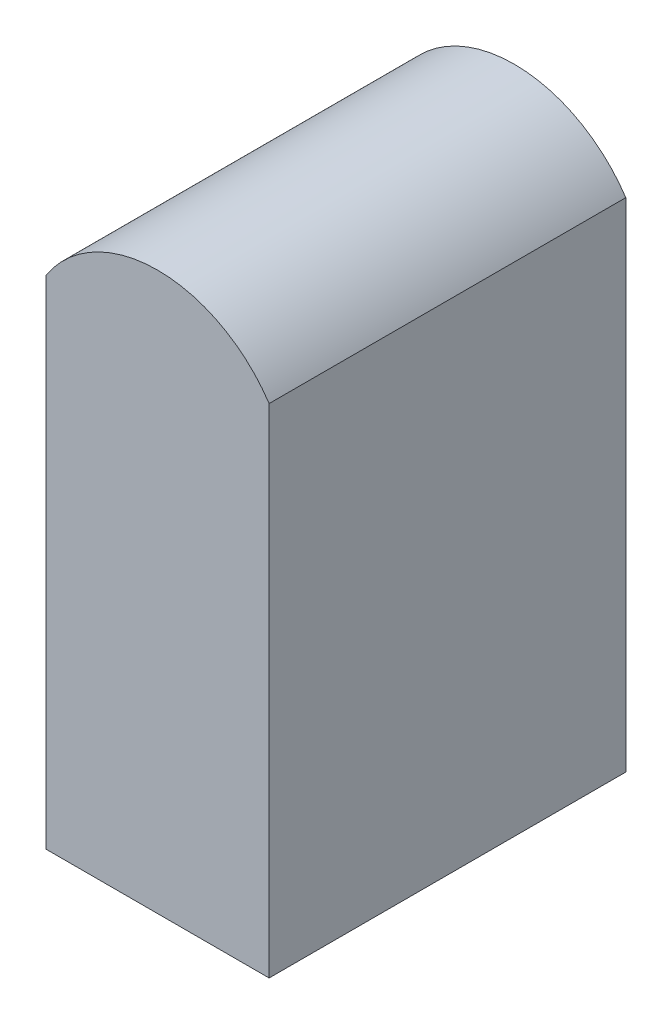
ISO-10303-21;
HEADER;
FILE_DESCRIPTION(('STEP AP214'),'2;1');
FILE_NAME('part.step','',(''),(''),'','','');
FILE_SCHEMA(('AUTOMOTIVE_DESIGN { 1 0 10303 214 1 1 1 1 }'));
ENDSEC;
DATA;
#1=APPLICATION_CONTEXT('core data for automotive mechanical design processes');
#2=APPLICATION_PROTOCOL_DEFINITION('international standard','automotive_design',2000,#1);
#3=PRODUCT_CONTEXT('',#1,'mechanical');
#4=PRODUCT('Part','Part','',(#3));
#5=PRODUCT_RELATED_PRODUCT_CATEGORY('part','',(#4));
#6=PRODUCT_DEFINITION_FORMATION('','',#4);
#7=PRODUCT_DEFINITION_CONTEXT('part definition',#1,'design');
#8=PRODUCT_DEFINITION('design','',#6,#7);
#9=PRODUCT_DEFINITION_SHAPE('','',#8);
#10=(LENGTH_UNIT() NAMED_UNIT(*) SI_UNIT(.MILLI.,.METRE.));
#11=(NAMED_UNIT(*) PLANE_ANGLE_UNIT() SI_UNIT($,.RADIAN.));
#12=(NAMED_UNIT(*) SI_UNIT($,.STERADIAN.) SOLID_ANGLE_UNIT());
#13=UNCERTAINTY_MEASURE_WITH_UNIT(LENGTH_MEASURE(1.E-05),#10,'distance_accuracy_value','');
#14=(GEOMETRIC_REPRESENTATION_CONTEXT(3) GLOBAL_UNCERTAINTY_ASSIGNED_CONTEXT((#13)) GLOBAL_UNIT_ASSIGNED_CONTEXT((#10,
#11,#12)) REPRESENTATION_CONTEXT('',''));
#15=CARTESIAN_POINT('',(0.,0.,0.));
#16=DIRECTION('',(0.,0.,1.));
#17=DIRECTION('',(1.,0.,0.));
#18=AXIS2_PLACEMENT_3D('',#15,#16,#17);
#19=CARTESIAN_POINT('',(-1.,0.,1.6));
#20=DIRECTION('',(1.,0.,0.));
#21=DIRECTION('',(0.,1.,0.));
#22=AXIS2_PLACEMENT_3D('',#19,#20,#21);
#23=PLANE('',#22);
#24=DIRECTION('',(0.,-1.,0.));
#25=VECTOR('',#24,1.);
#26=CARTESIAN_POINT('',(-1.,0.,1.6));
#27=LINE('',#26,#25);
#28=CARTESIAN_POINT('',(-1.,-0.536675041928922,1.6));
#29=VERTEX_POINT('',#28);
#30=CARTESIAN_POINT('',(-1.,-5.,1.6));
#31=VERTEX_POINT('',#30);
#32=EDGE_CURVE('E74',#29,#31,#27,.T.);
#33=ORIENTED_EDGE('',*,*,#32,.F.);
#34=DIRECTION('',(0.,0.,1.));
#35=VECTOR('',#34,1.);
#36=CARTESIAN_POINT('',(-1.,-0.536675041928922,-1.6));
#37=LINE('',#36,#35);
#38=CARTESIAN_POINT('',(-1.,-0.536675041928922,-1.6));
#39=VERTEX_POINT('',#38);
#40=EDGE_CURVE('E58',#39,#29,#37,.T.);
#41=ORIENTED_EDGE('',*,*,#40,.F.);
#42=DIRECTION('',(0.,-1.,0.));
#43=VECTOR('',#42,1.);
#44=CARTESIAN_POINT('',(-1.,0.,-1.6));
#45=LINE('',#44,#43);
#46=CARTESIAN_POINT('',(-1.,-5.,-1.6));
#47=VERTEX_POINT('',#46);
#48=EDGE_CURVE('E85',#39,#47,#45,.T.);
#49=ORIENTED_EDGE('',*,*,#48,.T.);
#50=DIRECTION('',(0.,0.,-1.));
#51=VECTOR('',#50,1.);
#52=CARTESIAN_POINT('',(-1.,-5.,1.6));
#53=LINE('',#52,#51);
#54=EDGE_CURVE('E24',#31,#47,#53,.T.);
#55=ORIENTED_EDGE('',*,*,#54,.F.);
#56=EDGE_LOOP('',(#33,#41,#49,#55));
#57=FACE_BOUND('',#56,.T.);
#58=ADVANCED_FACE('F17',(#57),#23,.F.);
#59=CARTESIAN_POINT('',(-1.,-5.,1.6));
#60=DIRECTION('',(0.,1.,0.));
#61=DIRECTION('',(0.,0.,1.));
#62=AXIS2_PLACEMENT_3D('',#59,#60,#61);
#63=PLANE('',#62);
#64=DIRECTION('',(1.,0.,0.));
#65=VECTOR('',#64,1.);
#66=CARTESIAN_POINT('',(-1.,-5.,-1.6));
#67=LINE('',#66,#65);
#68=CARTESIAN_POINT('',(1.,-5.,-1.6));
#69=VERTEX_POINT('',#68);
#70=EDGE_CURVE('E82',#47,#69,#67,.T.);
#71=ORIENTED_EDGE('',*,*,#70,.T.);
#72=DIRECTION('',(0.,0.,-1.));
#73=VECTOR('',#72,1.);
#74=CARTESIAN_POINT('',(1.,-5.,1.6));
#75=LINE('',#74,#73);
#76=CARTESIAN_POINT('',(1.,-5.,1.6));
#77=VERTEX_POINT('',#76);
#78=EDGE_CURVE('E71',#77,#69,#75,.T.);
#79=ORIENTED_EDGE('',*,*,#78,.F.);
#80=DIRECTION('',(1.,0.,0.));
#81=VECTOR('',#80,1.);
#82=CARTESIAN_POINT('',(-1.,-5.,1.6));
#83=LINE('',#82,#81);
#84=EDGE_CURVE('E38',#31,#77,#83,.T.);
#85=ORIENTED_EDGE('',*,*,#84,.F.);
#86=ORIENTED_EDGE('',*,*,#54,.T.);
#87=EDGE_LOOP('',(#71,#79,#85,#86));
#88=FACE_BOUND('',#87,.T.);
#89=ADVANCED_FACE('F80',(#88),#63,.F.);
#90=CARTESIAN_POINT('',(1.,0.,1.6));
#91=DIRECTION('',(-1.,0.,0.));
#92=DIRECTION('',(0.,-1.,0.));
#93=AXIS2_PLACEMENT_3D('',#90,#91,#92);
#94=PLANE('',#93);
#95=DIRECTION('',(0.,1.,0.));
#96=VECTOR('',#95,1.);
#97=CARTESIAN_POINT('',(1.,0.,-1.6));
#98=LINE('',#97,#96);
#99=CARTESIAN_POINT('',(1.,-0.536675041928922,-1.6));
#100=VERTEX_POINT('',#99);
#101=EDGE_CURVE('E68',#69,#100,#98,.T.);
#102=ORIENTED_EDGE('',*,*,#101,.T.);
#103=DIRECTION('',(0.,0.,1.));
#104=VECTOR('',#103,1.);
#105=CARTESIAN_POINT('',(1.,-0.536675041928922,-1.6));
#106=LINE('',#105,#104);
#107=CARTESIAN_POINT('',(1.,-0.536675041928922,1.6));
#108=VERTEX_POINT('',#107);
#109=EDGE_CURVE('E31',#100,#108,#106,.T.);
#110=ORIENTED_EDGE('',*,*,#109,.T.);
#111=DIRECTION('',(0.,1.,0.));
#112=VECTOR('',#111,1.);
#113=CARTESIAN_POINT('',(1.,0.,1.6));
#114=LINE('',#113,#112);
#115=EDGE_CURVE('E66',#77,#108,#114,.T.);
#116=ORIENTED_EDGE('',*,*,#115,.F.);
#117=ORIENTED_EDGE('',*,*,#78,.T.);
#118=EDGE_LOOP('',(#102,#110,#116,#117));
#119=FACE_BOUND('',#118,.T.);
#120=ADVANCED_FACE('F64',(#119),#94,.F.);
#121=CARTESIAN_POINT('',(-1.,-5.,1.6));
#122=DIRECTION('',(0.,0.,1.));
#123=DIRECTION('',(1.,0.,0.));
#124=AXIS2_PLACEMENT_3D('',#121,#122,#123);
#125=PLANE('',#124);
#126=CARTESIAN_POINT('',(0.,-1.2,1.6));
#127=DIRECTION('',(0.,0.,-1.));
#128=DIRECTION('',(-1.,0.,0.));
#129=AXIS2_PLACEMENT_3D('',#126,#127,#128);
#130=CIRCLE('',#129,1.2);
#131=EDGE_CURVE('E55',#29,#108,#130,.T.);
#132=ORIENTED_EDGE('',*,*,#131,.F.);
#133=ORIENTED_EDGE('',*,*,#32,.T.);
#134=ORIENTED_EDGE('',*,*,#84,.T.);
#135=ORIENTED_EDGE('',*,*,#115,.T.);
#136=EDGE_LOOP('',(#132,#133,#134,#135));
#137=FACE_BOUND('',#136,.T.);
#138=ADVANCED_FACE('F70',(#137),#125,.T.);
#139=CARTESIAN_POINT('',(-1.,-5.,-1.6));
#140=DIRECTION('',(0.,0.,1.));
#141=DIRECTION('',(1.,0.,0.));
#142=AXIS2_PLACEMENT_3D('',#139,#140,#141);
#143=PLANE('',#142);
#144=ORIENTED_EDGE('',*,*,#48,.F.);
#145=CARTESIAN_POINT('',(0.,-1.2,-1.6));
#146=DIRECTION('',(0.,0.,1.));
#147=DIRECTION('',(1.,0.,0.));
#148=AXIS2_PLACEMENT_3D('',#145,#146,#147);
#149=CIRCLE('',#148,1.2);
#150=EDGE_CURVE('E11',#39,#100,#149,.F.);
#151=ORIENTED_EDGE('',*,*,#150,.T.);
#152=ORIENTED_EDGE('',*,*,#101,.F.);
#153=ORIENTED_EDGE('',*,*,#70,.F.);
#154=EDGE_LOOP('',(#144,#151,#152,#153));
#155=FACE_BOUND('',#154,.T.);
#156=ADVANCED_FACE('F88',(#155),#143,.F.);
#157=CARTESIAN_POINT('',(0.,-1.2,-1.6));
#158=DIRECTION('',(0.,0.,1.));
#159=DIRECTION('',(1.,0.,0.));
#160=AXIS2_PLACEMENT_3D('',#157,#158,#159);
#161=CYLINDRICAL_SURFACE('',#160,1.2);
#162=ORIENTED_EDGE('',*,*,#131,.T.);
#163=ORIENTED_EDGE('',*,*,#109,.F.);
#164=ORIENTED_EDGE('',*,*,#150,.F.);
#165=ORIENTED_EDGE('',*,*,#40,.T.);
#166=EDGE_LOOP('',(#162,#163,#164,#165));
#167=FACE_BOUND('',#166,.T.);
#168=ADVANCED_FACE('F56',(#167),#161,.T.);
#169=CLOSED_SHELL('',(#58,#89,#120,#138,#156,#168));
#170=MANIFOLD_SOLID_BREP('B1',#169);
#171=ADVANCED_BREP_SHAPE_REPRESENTATION('',(#18,#170),#14);
#172=SHAPE_DEFINITION_REPRESENTATION(#9,#171);
ENDSEC;
END-ISO-10303-21;
